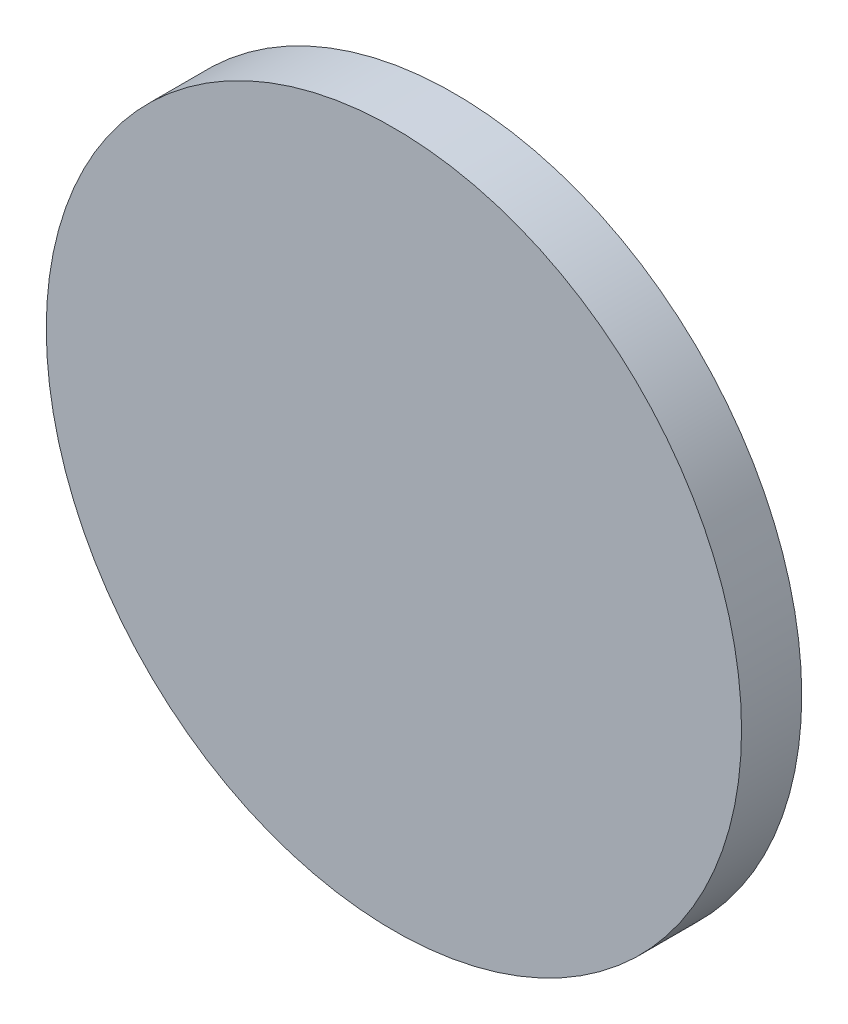
ISO-10303-21;
HEADER;
FILE_DESCRIPTION(('STEP AP214'),'2;1');
FILE_NAME('part.step','',(''),(''),'','','');
FILE_SCHEMA(('AUTOMOTIVE_DESIGN { 1 0 10303 214 1 1 1 1 }'));
ENDSEC;
DATA;
#1=APPLICATION_CONTEXT('core data for automotive mechanical design processes');
#2=APPLICATION_PROTOCOL_DEFINITION('international standard','automotive_design',2000,#1);
#3=PRODUCT_CONTEXT('',#1,'mechanical');
#4=PRODUCT('Part','Part','',(#3));
#5=PRODUCT_RELATED_PRODUCT_CATEGORY('part','',(#4));
#6=PRODUCT_DEFINITION_FORMATION('','',#4);
#7=PRODUCT_DEFINITION_CONTEXT('part definition',#1,'design');
#8=PRODUCT_DEFINITION('design','',#6,#7);
#9=PRODUCT_DEFINITION_SHAPE('','',#8);
#10=(LENGTH_UNIT() NAMED_UNIT(*) SI_UNIT(.MILLI.,.METRE.));
#11=(NAMED_UNIT(*) PLANE_ANGLE_UNIT() SI_UNIT($,.RADIAN.));
#12=(NAMED_UNIT(*) SI_UNIT($,.STERADIAN.) SOLID_ANGLE_UNIT());
#13=UNCERTAINTY_MEASURE_WITH_UNIT(LENGTH_MEASURE(1.E-05),#10,'distance_accuracy_value','');
#14=(GEOMETRIC_REPRESENTATION_CONTEXT(3) GLOBAL_UNCERTAINTY_ASSIGNED_CONTEXT((#13)) GLOBAL_UNIT_ASSIGNED_CONTEXT((#10,
#11,#12)) REPRESENTATION_CONTEXT('',''));
#15=CARTESIAN_POINT('',(0.,0.,0.));
#16=DIRECTION('',(0.,0.,1.));
#17=DIRECTION('',(1.,0.,0.));
#18=AXIS2_PLACEMENT_3D('',#15,#16,#17);
#19=CARTESIAN_POINT('',(0.,0.,0.));
#20=DIRECTION('',(0.,0.,1.));
#21=DIRECTION('',(1.,0.,0.));
#22=AXIS2_PLACEMENT_3D('',#19,#20,#21);
#23=PLANE('',#22);
#24=CARTESIAN_POINT('',(0.,0.,0.));
#25=DIRECTION('',(0.,0.,1.));
#26=DIRECTION('',(1.,0.,0.));
#27=AXIS2_PLACEMENT_3D('',#24,#25,#26);
#28=CIRCLE('',#27,5.775);
#29=CARTESIAN_POINT('',(5.775,0.,0.));
#30=VERTEX_POINT('',#29);
#31=EDGE_CURVE('E18',#30,#30,#28,.T.);
#32=ORIENTED_EDGE('',*,*,#31,.F.);
#33=EDGE_LOOP('',(#32));
#34=FACE_BOUND('',#33,.T.);
#35=ADVANCED_FACE('F15',(#34),#23,.F.);
#36=CARTESIAN_POINT('',(0.,0.,0.));
#37=DIRECTION('',(0.,0.,1.));
#38=DIRECTION('',(1.,0.,0.));
#39=AXIS2_PLACEMENT_3D('',#36,#37,#38);
#40=CYLINDRICAL_SURFACE('',#39,5.775);
#41=ORIENTED_EDGE('',*,*,#31,.T.);
#42=EDGE_LOOP('',(#41));
#43=FACE_BOUND('',#42,.T.);
#44=CARTESIAN_POINT('',(0.,0.,1.));
#45=DIRECTION('',(0.,0.,1.));
#46=DIRECTION('',(1.,0.,0.));
#47=AXIS2_PLACEMENT_3D('',#44,#45,#46);
#48=CIRCLE('',#47,5.775);
#49=CARTESIAN_POINT('',(5.775,0.,1.));
#50=VERTEX_POINT('',#49);
#51=EDGE_CURVE('E10',#50,#50,#48,.T.);
#52=ORIENTED_EDGE('',*,*,#51,.F.);
#53=EDGE_LOOP('',(#52));
#54=FACE_BOUND('',#53,.T.);
#55=ADVANCED_FACE('F27',(#43,#54),#40,.T.);
#56=CARTESIAN_POINT('',(0.,0.,1.));
#57=DIRECTION('',(0.,0.,1.));
#58=DIRECTION('',(1.,0.,0.));
#59=AXIS2_PLACEMENT_3D('',#56,#57,#58);
#60=PLANE('',#59);
#61=ORIENTED_EDGE('',*,*,#51,.T.);
#62=EDGE_LOOP('',(#61));
#63=FACE_BOUND('',#62,.T.);
#64=ADVANCED_FACE('F35',(#63),#60,.T.);
#65=CLOSED_SHELL('',(#35,#55,#64));
#66=MANIFOLD_SOLID_BREP('B1',#65);
#67=ADVANCED_BREP_SHAPE_REPRESENTATION('',(#18,#66),#14);
#68=SHAPE_DEFINITION_REPRESENTATION(#9,#67);
ENDSEC;
END-ISO-10303-21;
